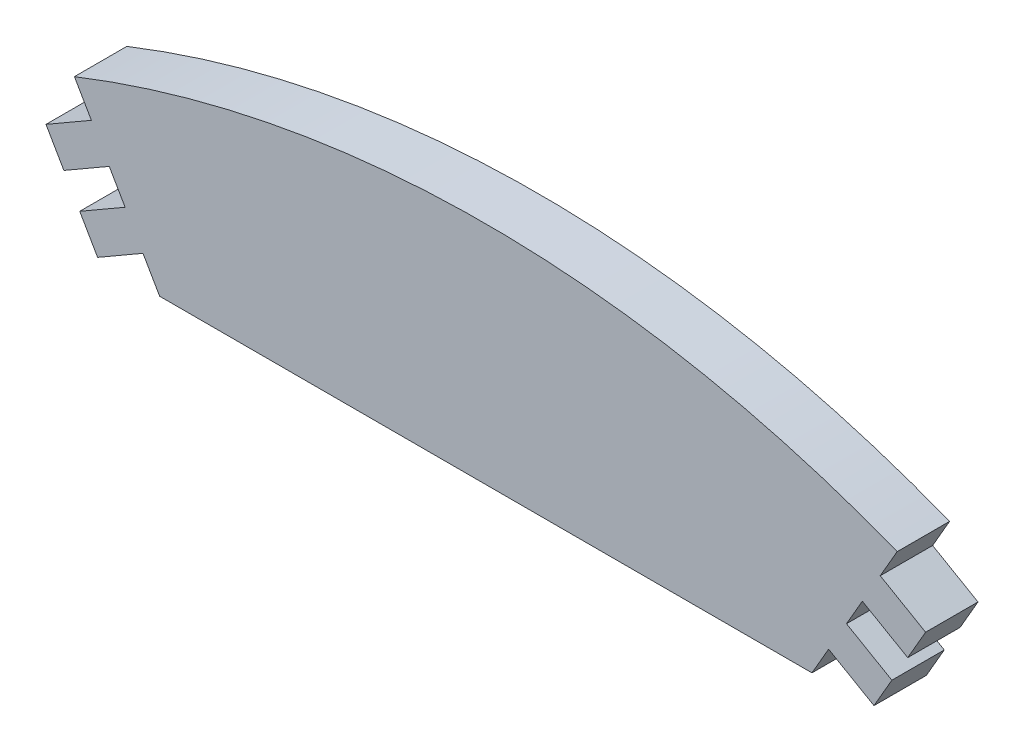
ISO-10303-21;
HEADER;
FILE_DESCRIPTION(('STEP AP214'),'2;1');
FILE_NAME('part.step','',(''),(''),'','','');
FILE_SCHEMA(('AUTOMOTIVE_DESIGN { 1 0 10303 214 1 1 1 1 }'));
ENDSEC;
DATA;
#1=APPLICATION_CONTEXT('core data for automotive mechanical design processes');
#2=APPLICATION_PROTOCOL_DEFINITION('international standard','automotive_design',2000,#1);
#3=PRODUCT_CONTEXT('',#1,'mechanical');
#4=PRODUCT('Part','Part','',(#3));
#5=PRODUCT_RELATED_PRODUCT_CATEGORY('part','',(#4));
#6=PRODUCT_DEFINITION_FORMATION('','',#4);
#7=PRODUCT_DEFINITION_CONTEXT('part definition',#1,'design');
#8=PRODUCT_DEFINITION('design','',#6,#7);
#9=PRODUCT_DEFINITION_SHAPE('','',#8);
#10=(LENGTH_UNIT() NAMED_UNIT(*) SI_UNIT(.MILLI.,.METRE.));
#11=(NAMED_UNIT(*) PLANE_ANGLE_UNIT() SI_UNIT($,.RADIAN.));
#12=(NAMED_UNIT(*) SI_UNIT($,.STERADIAN.) SOLID_ANGLE_UNIT());
#13=UNCERTAINTY_MEASURE_WITH_UNIT(LENGTH_MEASURE(1.E-05),#10,'distance_accuracy_value','');
#14=(GEOMETRIC_REPRESENTATION_CONTEXT(3) GLOBAL_UNCERTAINTY_ASSIGNED_CONTEXT((#13)) GLOBAL_UNIT_ASSIGNED_CONTEXT((#10,
#11,#12)) REPRESENTATION_CONTEXT('',''));
#15=CARTESIAN_POINT('',(0.,0.,0.));
#16=DIRECTION('',(0.,0.,1.));
#17=DIRECTION('',(1.,0.,0.));
#18=AXIS2_PLACEMENT_3D('',#15,#16,#17);
#19=CARTESIAN_POINT('',(-32.057735026919,87.9,5.15));
#20=DIRECTION('',(0.866025403784439,0.499999999999999,0.));
#21=DIRECTION('',(-0.499999999999999,0.866025403784439,0.));
#22=AXIS2_PLACEMENT_3D('',#19,#20,#21);
#23=PLANE('',#22);
#24=DIRECTION('',(0.499999999999999,-0.866025403784439,0.));
#25=VECTOR('',#24,1.);
#26=CARTESIAN_POINT('',(-32.057735026919,87.9,0.));
#27=LINE('',#26,#25);
#28=CARTESIAN_POINT('',(-33.6943323793796,90.7346697659945,0.));
#29=VERTEX_POINT('',#28);
#30=CARTESIAN_POINT('',(-32.057735026919,87.9,0.));
#31=VERTEX_POINT('',#30);
#32=EDGE_CURVE('E356',#29,#31,#27,.T.);
#33=ORIENTED_EDGE('',*,*,#32,.T.);
#34=DIRECTION('',(0.,0.,-1.));
#35=VECTOR('',#34,1.);
#36=CARTESIAN_POINT('',(-32.057735026919,87.9,5.15));
#37=LINE('',#36,#35);
#38=CARTESIAN_POINT('',(-32.057735026919,87.9,5.15));
#39=VERTEX_POINT('',#38);
#40=EDGE_CURVE('E12',#39,#31,#37,.T.);
#41=ORIENTED_EDGE('',*,*,#40,.F.);
#42=DIRECTION('',(0.499999999999999,-0.866025403784439,0.));
#43=VECTOR('',#42,1.);
#44=CARTESIAN_POINT('',(-32.057735026919,87.9,5.15));
#45=LINE('',#44,#43);
#46=CARTESIAN_POINT('',(-33.6943323793796,90.7346697659945,5.15));
#47=VERTEX_POINT('',#46);
#48=EDGE_CURVE('E285',#47,#39,#45,.T.);
#49=ORIENTED_EDGE('',*,*,#48,.F.);
#50=DIRECTION('',(0.,0.,-1.));
#51=VECTOR('',#50,1.);
#52=CARTESIAN_POINT('',(-33.6943323793796,90.7346697659945,5.15));
#53=LINE('',#52,#51);
#54=EDGE_CURVE('E203',#47,#29,#53,.T.);
#55=ORIENTED_EDGE('',*,*,#54,.T.);
#56=EDGE_LOOP('',(#33,#41,#49,#55));
#57=FACE_BOUND('',#56,.T.);
#58=ADVANCED_FACE('F36',(#57),#23,.F.);
#59=CARTESIAN_POINT('',(-32.057735026919,87.9,5.15));
#60=DIRECTION('',(0.,1.,0.));
#61=DIRECTION('',(0.,0.,1.));
#62=AXIS2_PLACEMENT_3D('',#59,#60,#61);
#63=PLANE('',#62);
#64=DIRECTION('',(1.,0.,0.));
#65=VECTOR('',#64,1.);
#66=CARTESIAN_POINT('',(-32.057735026919,87.9,0.));
#67=LINE('',#66,#65);
#68=CARTESIAN_POINT('',(32.057735026919,87.9,0.));
#69=VERTEX_POINT('',#68);
#70=EDGE_CURVE('E350',#31,#69,#67,.T.);
#71=ORIENTED_EDGE('',*,*,#70,.T.);
#72=DIRECTION('',(0.,0.,-1.));
#73=VECTOR('',#72,1.);
#74=CARTESIAN_POINT('',(32.057735026919,87.9,5.15));
#75=LINE('',#74,#73);
#76=CARTESIAN_POINT('',(32.057735026919,87.9,5.15));
#77=VERTEX_POINT('',#76);
#78=EDGE_CURVE('E44',#77,#69,#75,.T.);
#79=ORIENTED_EDGE('',*,*,#78,.F.);
#80=DIRECTION('',(1.,0.,0.));
#81=VECTOR('',#80,1.);
#82=CARTESIAN_POINT('',(-32.057735026919,87.9,5.15));
#83=LINE('',#82,#81);
#84=EDGE_CURVE('E131',#39,#77,#83,.T.);
#85=ORIENTED_EDGE('',*,*,#84,.F.);
#86=ORIENTED_EDGE('',*,*,#40,.T.);
#87=EDGE_LOOP('',(#71,#79,#85,#86));
#88=FACE_BOUND('',#87,.T.);
#89=ADVANCED_FACE('F401',(#88),#63,.F.);
#90=CARTESIAN_POINT('',(32.057735026919,87.9,5.15));
#91=DIRECTION('',(-0.866025403784439,0.499999999999999,0.));
#92=DIRECTION('',(-0.499999999999999,-0.866025403784439,0.));
#93=AXIS2_PLACEMENT_3D('',#90,#91,#92);
#94=PLANE('',#93);
#95=DIRECTION('',(0.499999999999999,0.866025403784439,0.));
#96=VECTOR('',#95,1.);
#97=CARTESIAN_POINT('',(32.057735026919,87.9,0.));
#98=LINE('',#97,#96);
#99=CARTESIAN_POINT('',(33.6943323793796,90.7346697659945,0.));
#100=VERTEX_POINT('',#99);
#101=EDGE_CURVE('E345',#69,#100,#98,.T.);
#102=ORIENTED_EDGE('',*,*,#101,.T.);
#103=DIRECTION('',(0.,0.,-1.));
#104=VECTOR('',#103,1.);
#105=CARTESIAN_POINT('',(33.6943323793796,90.7346697659945,5.15));
#106=LINE('',#105,#104);
#107=CARTESIAN_POINT('',(33.6943323793796,90.7346697659945,5.15));
#108=VERTEX_POINT('',#107);
#109=EDGE_CURVE('E337',#108,#100,#106,.T.);
#110=ORIENTED_EDGE('',*,*,#109,.F.);
#111=DIRECTION('',(0.499999999999999,0.866025403784439,0.));
#112=VECTOR('',#111,1.);
#113=CARTESIAN_POINT('',(32.057735026919,87.9,5.15));
#114=LINE('',#113,#112);
#115=EDGE_CURVE('E277',#77,#108,#114,.T.);
#116=ORIENTED_EDGE('',*,*,#115,.F.);
#117=ORIENTED_EDGE('',*,*,#78,.T.);
#118=EDGE_LOOP('',(#102,#110,#116,#117));
#119=FACE_BOUND('',#118,.T.);
#120=ADVANCED_FACE('F343',(#119),#94,.F.);
#121=CARTESIAN_POINT('',(33.6943323793796,90.7346697659945,5.15));
#122=DIRECTION('',(0.5,0.866025403784439,0.));
#123=DIRECTION('',(-0.866025403784439,0.5,0.));
#124=AXIS2_PLACEMENT_3D('',#121,#122,#123);
#125=PLANE('',#124);
#126=DIRECTION('',(0.866025403784439,-0.5,0.));
#127=VECTOR('',#126,1.);
#128=CARTESIAN_POINT('',(33.6943323793796,90.7346697659945,0.));
#129=LINE('',#128,#127);
#130=CARTESIAN_POINT('',(38.1543632088692,88.1596697659946,0.));
#131=VERTEX_POINT('',#130);
#132=EDGE_CURVE('E352',#100,#131,#129,.T.);
#133=ORIENTED_EDGE('',*,*,#132,.T.);
#134=DIRECTION('',(0.,0.,-1.));
#135=VECTOR('',#134,1.);
#136=CARTESIAN_POINT('',(38.1543632088692,88.1596697659946,5.15));
#137=LINE('',#136,#135);
#138=CARTESIAN_POINT('',(38.1543632088692,88.1596697659946,5.15));
#139=VERTEX_POINT('',#138);
#140=EDGE_CURVE('E334',#139,#131,#137,.T.);
#141=ORIENTED_EDGE('',*,*,#140,.F.);
#142=DIRECTION('',(0.866025403784439,-0.5,0.));
#143=VECTOR('',#142,1.);
#144=CARTESIAN_POINT('',(33.6943323793796,90.7346697659945,5.15));
#145=LINE('',#144,#143);
#146=EDGE_CURVE('E273',#108,#139,#145,.T.);
#147=ORIENTED_EDGE('',*,*,#146,.F.);
#148=ORIENTED_EDGE('',*,*,#109,.T.);
#149=EDGE_LOOP('',(#133,#141,#147,#148));
#150=FACE_BOUND('',#149,.T.);
#151=ADVANCED_FACE('F408',(#150),#125,.F.);
#152=CARTESIAN_POINT('',(38.1543632088692,88.1596697659946,5.15));
#153=DIRECTION('',(-0.866025403784438,0.500000000000001,0.));
#154=DIRECTION('',(-0.500000000000001,-0.866025403784438,0.));
#155=AXIS2_PLACEMENT_3D('',#152,#153,#154);
#156=PLANE('',#155);
#157=DIRECTION('',(0.500000000000001,0.866025403784438,0.));
#158=VECTOR('',#157,1.);
#159=CARTESIAN_POINT('',(38.1543632088692,88.1596697659946,0.));
#160=LINE('',#159,#158);
#161=CARTESIAN_POINT('',(39.9120930478703,91.2041471531244,0.));
#162=VERTEX_POINT('',#161);
#163=EDGE_CURVE('E354',#131,#162,#160,.T.);
#164=ORIENTED_EDGE('',*,*,#163,.T.);
#165=DIRECTION('',(0.,0.,-1.));
#166=VECTOR('',#165,1.);
#167=CARTESIAN_POINT('',(39.9120930478703,91.2041471531244,5.15));
#168=LINE('',#167,#166);
#169=CARTESIAN_POINT('',(39.9120930478703,91.2041471531244,5.15));
#170=VERTEX_POINT('',#169);
#171=EDGE_CURVE('E331',#170,#162,#168,.T.);
#172=ORIENTED_EDGE('',*,*,#171,.F.);
#173=DIRECTION('',(0.500000000000001,0.866025403784438,0.));
#174=VECTOR('',#173,1.);
#175=CARTESIAN_POINT('',(38.1543632088692,88.1596697659946,5.15));
#176=LINE('',#175,#174);
#177=EDGE_CURVE('E270',#139,#170,#176,.T.);
#178=ORIENTED_EDGE('',*,*,#177,.F.);
#179=ORIENTED_EDGE('',*,*,#140,.T.);
#180=EDGE_LOOP('',(#164,#172,#178,#179));
#181=FACE_BOUND('',#180,.T.);
#182=ADVANCED_FACE('F413',(#181),#156,.F.);
#183=CARTESIAN_POINT('',(39.9120930478703,91.2041471531244,5.15));
#184=DIRECTION('',(-0.500000000000001,-0.866025403784438,0.));
#185=DIRECTION('',(0.866025403784438,-0.500000000000001,0.));
#186=AXIS2_PLACEMENT_3D('',#183,#184,#185);
#187=PLANE('',#186);
#188=DIRECTION('',(-0.866025403784438,0.500000000000001,0.));
#189=VECTOR('',#188,1.);
#190=CARTESIAN_POINT('',(39.9120930478703,91.2041471531244,0.));
#191=LINE('',#190,#189);
#192=CARTESIAN_POINT('',(35.4520622183807,93.7791471531243,0.));
#193=VERTEX_POINT('',#192);
#194=EDGE_CURVE('E360',#162,#193,#191,.T.);
#195=ORIENTED_EDGE('',*,*,#194,.T.);
#196=DIRECTION('',(0.,0.,-1.));
#197=VECTOR('',#196,1.);
#198=CARTESIAN_POINT('',(35.4520622183807,93.7791471531243,5.15));
#199=LINE('',#198,#197);
#200=CARTESIAN_POINT('',(35.4520622183807,93.7791471531243,5.15));
#201=VERTEX_POINT('',#200);
#202=EDGE_CURVE('E328',#201,#193,#199,.T.);
#203=ORIENTED_EDGE('',*,*,#202,.F.);
#204=DIRECTION('',(-0.866025403784438,0.500000000000001,0.));
#205=VECTOR('',#204,1.);
#206=CARTESIAN_POINT('',(39.9120930478703,91.2041471531244,5.15));
#207=LINE('',#206,#205);
#208=EDGE_CURVE('E262',#170,#201,#207,.T.);
#209=ORIENTED_EDGE('',*,*,#208,.F.);
#210=ORIENTED_EDGE('',*,*,#171,.T.);
#211=EDGE_LOOP('',(#195,#203,#209,#210));
#212=FACE_BOUND('',#211,.T.);
#213=ADVANCED_FACE('F417',(#212),#187,.F.);
#214=CARTESIAN_POINT('',(35.4520622183807,93.7791471531243,5.15));
#215=DIRECTION('',(-0.866025403784438,0.500000000000001,0.));
#216=DIRECTION('',(-0.500000000000001,-0.866025403784438,0.));
#217=AXIS2_PLACEMENT_3D('',#214,#215,#216);
#218=PLANE('',#217);
#219=DIRECTION('',(0.5,0.866025403784438,0.));
#220=VECTOR('',#219,1.);
#221=CARTESIAN_POINT('',(35.4520622183807,93.7791471531243,0.));
#222=LINE('',#221,#220);
#223=CARTESIAN_POINT('',(37.0097920573818,96.4772143787403,0.));
#224=VERTEX_POINT('',#223);
#225=EDGE_CURVE('E362',#193,#224,#222,.T.);
#226=ORIENTED_EDGE('',*,*,#225,.T.);
#227=DIRECTION('',(0.,0.,-1.));
#228=VECTOR('',#227,1.);
#229=CARTESIAN_POINT('',(37.0097920573818,96.4772143787403,5.15));
#230=LINE('',#229,#228);
#231=CARTESIAN_POINT('',(37.0097920573818,96.4772143787403,5.15));
#232=VERTEX_POINT('',#231);
#233=EDGE_CURVE('E325',#232,#224,#230,.T.);
#234=ORIENTED_EDGE('',*,*,#233,.F.);
#235=DIRECTION('',(0.5,0.866025403784438,0.));
#236=VECTOR('',#235,1.);
#237=CARTESIAN_POINT('',(35.4520622183807,93.7791471531243,5.15));
#238=LINE('',#237,#236);
#239=EDGE_CURVE('E258',#201,#232,#238,.T.);
#240=ORIENTED_EDGE('',*,*,#239,.F.);
#241=ORIENTED_EDGE('',*,*,#202,.T.);
#242=EDGE_LOOP('',(#226,#234,#240,#241));
#243=FACE_BOUND('',#242,.T.);
#244=ADVANCED_FACE('F421',(#243),#218,.F.);
#245=CARTESIAN_POINT('',(37.0097920573818,96.4772143787403,5.15));
#246=DIRECTION('',(0.499999999999999,0.866025403784439,0.));
#247=DIRECTION('',(-0.866025403784439,0.5,0.));
#248=AXIS2_PLACEMENT_3D('',#245,#246,#247);
#249=PLANE('',#248);
#250=DIRECTION('',(0.866025403784439,-0.499999999999999,0.));
#251=VECTOR('',#250,1.);
#252=CARTESIAN_POINT('',(37.0097920573818,96.4772143787403,0.));
#253=LINE('',#252,#251);
#254=CARTESIAN_POINT('',(41.4698228868716,93.9022143787403,0.));
#255=VERTEX_POINT('',#254);
#256=EDGE_CURVE('E364',#224,#255,#253,.T.);
#257=ORIENTED_EDGE('',*,*,#256,.T.);
#258=DIRECTION('',(0.,0.,-1.));
#259=VECTOR('',#258,1.);
#260=CARTESIAN_POINT('',(41.4698228868716,93.9022143787403,5.15));
#261=LINE('',#260,#259);
#262=CARTESIAN_POINT('',(41.4698228868716,93.9022143787403,5.15));
#263=VERTEX_POINT('',#262);
#264=EDGE_CURVE('E322',#263,#255,#261,.T.);
#265=ORIENTED_EDGE('',*,*,#264,.F.);
#266=DIRECTION('',(0.866025403784439,-0.499999999999999,0.));
#267=VECTOR('',#266,1.);
#268=CARTESIAN_POINT('',(37.0097920573818,96.4772143787403,5.15));
#269=LINE('',#268,#267);
#270=EDGE_CURVE('E254',#232,#263,#269,.T.);
#271=ORIENTED_EDGE('',*,*,#270,.F.);
#272=ORIENTED_EDGE('',*,*,#233,.T.);
#273=EDGE_LOOP('',(#257,#265,#271,#272));
#274=FACE_BOUND('',#273,.T.);
#275=ADVANCED_FACE('F425',(#274),#249,.F.);
#276=CARTESIAN_POINT('',(41.4698228868716,93.9022143787403,5.15));
#277=DIRECTION('',(-0.866025403784439,0.499999999999999,0.));
#278=DIRECTION('',(-0.499999999999999,-0.866025403784439,0.));
#279=AXIS2_PLACEMENT_3D('',#276,#277,#278);
#280=PLANE('',#279);
#281=DIRECTION('',(0.499999999999999,0.866025403784439,0.));
#282=VECTOR('',#281,1.);
#283=CARTESIAN_POINT('',(41.4698228868716,93.9022143787403,0.));
#284=LINE('',#283,#282);
#285=CARTESIAN_POINT('',(43.2275527258728,96.9466917658702,0.));
#286=VERTEX_POINT('',#285);
#287=EDGE_CURVE('E366',#255,#286,#284,.T.);
#288=ORIENTED_EDGE('',*,*,#287,.T.);
#289=DIRECTION('',(0.,0.,-1.));
#290=VECTOR('',#289,1.);
#291=CARTESIAN_POINT('',(43.2275527258728,96.9466917658702,5.15));
#292=LINE('',#291,#290);
#293=CARTESIAN_POINT('',(43.2275527258728,96.9466917658702,5.15));
#294=VERTEX_POINT('',#293);
#295=EDGE_CURVE('E319',#294,#286,#292,.T.);
#296=ORIENTED_EDGE('',*,*,#295,.F.);
#297=DIRECTION('',(0.499999999999999,0.866025403784439,0.));
#298=VECTOR('',#297,1.);
#299=CARTESIAN_POINT('',(41.4698228868716,93.9022143787403,5.15));
#300=LINE('',#299,#298);
#301=EDGE_CURVE('E251',#263,#294,#300,.T.);
#302=ORIENTED_EDGE('',*,*,#301,.F.);
#303=ORIENTED_EDGE('',*,*,#264,.T.);
#304=EDGE_LOOP('',(#288,#296,#302,#303));
#305=FACE_BOUND('',#304,.T.);
#306=ADVANCED_FACE('F429',(#305),#280,.F.);
#307=CARTESIAN_POINT('',(43.2275527258728,96.9466917658702,5.15));
#308=DIRECTION('',(-0.500000000000001,-0.866025403784438,0.));
#309=DIRECTION('',(0.866025403784438,-0.500000000000001,0.));
#310=AXIS2_PLACEMENT_3D('',#307,#308,#309);
#311=PLANE('',#310);
#312=DIRECTION('',(-0.866025403784438,0.500000000000001,0.));
#313=VECTOR('',#312,1.);
#314=CARTESIAN_POINT('',(43.2275527258728,96.9466917658702,0.));
#315=LINE('',#314,#313);
#316=CARTESIAN_POINT('',(38.7675218963829,99.5216917658702,0.));
#317=VERTEX_POINT('',#316);
#318=EDGE_CURVE('E368',#286,#317,#315,.T.);
#319=ORIENTED_EDGE('',*,*,#318,.T.);
#320=DIRECTION('',(0.,0.,-1.));
#321=VECTOR('',#320,1.);
#322=CARTESIAN_POINT('',(38.7675218963829,99.5216917658702,5.15));
#323=LINE('',#322,#321);
#324=CARTESIAN_POINT('',(38.7675218963829,99.5216917658702,5.15));
#325=VERTEX_POINT('',#324);
#326=EDGE_CURVE('E316',#325,#317,#323,.T.);
#327=ORIENTED_EDGE('',*,*,#326,.F.);
#328=DIRECTION('',(-0.866025403784438,0.500000000000001,0.));
#329=VECTOR('',#328,1.);
#330=CARTESIAN_POINT('',(43.2275527258728,96.9466917658702,5.15));
#331=LINE('',#330,#329);
#332=EDGE_CURVE('E243',#294,#325,#331,.T.);
#333=ORIENTED_EDGE('',*,*,#332,.F.);
#334=ORIENTED_EDGE('',*,*,#295,.T.);
#335=EDGE_LOOP('',(#319,#327,#333,#334));
#336=FACE_BOUND('',#335,.T.);
#337=ADVANCED_FACE('F433',(#336),#311,.F.);
#338=CARTESIAN_POINT('',(38.7675218963829,99.5216917658702,5.15));
#339=DIRECTION('',(-0.86602540378444,0.499999999999999,0.));
#340=DIRECTION('',(-0.499999999999999,-0.866025403784439,0.));
#341=AXIS2_PLACEMENT_3D('',#338,#339,#340);
#342=PLANE('',#341);
#343=DIRECTION('',(0.499999999999998,0.866025403784439,0.));
#344=VECTOR('',#343,1.);
#345=CARTESIAN_POINT('',(38.7675218963829,99.5216917658702,0.));
#346=LINE('',#345,#344);
#347=CARTESIAN_POINT('',(40.4332638413848,102.406841446912,0.));
#348=VERTEX_POINT('',#347);
#349=EDGE_CURVE('E370',#317,#348,#346,.T.);
#350=ORIENTED_EDGE('',*,*,#349,.T.);
#351=DIRECTION('',(0.,0.,-1.));
#352=VECTOR('',#351,1.);
#353=CARTESIAN_POINT('',(40.4332638413848,102.406841446912,5.15));
#354=LINE('',#353,#352);
#355=CARTESIAN_POINT('',(40.4332638413848,102.406841446912,5.15));
#356=VERTEX_POINT('',#355);
#357=EDGE_CURVE('E313',#356,#348,#354,.T.);
#358=ORIENTED_EDGE('',*,*,#357,.F.);
#359=DIRECTION('',(0.499999999999998,0.866025403784439,0.));
#360=VECTOR('',#359,1.);
#361=CARTESIAN_POINT('',(38.7675218963829,99.5216917658702,5.15));
#362=LINE('',#361,#360);
#363=EDGE_CURVE('E239',#325,#356,#362,.T.);
#364=ORIENTED_EDGE('',*,*,#363,.F.);
#365=ORIENTED_EDGE('',*,*,#326,.T.);
#366=EDGE_LOOP('',(#350,#358,#364,#365));
#367=FACE_BOUND('',#366,.T.);
#368=ADVANCED_FACE('F437',(#367),#342,.F.);
#369=CARTESIAN_POINT('',(0.,0.,5.15));
#370=DIRECTION('',(0.,0.,-1.));
#371=DIRECTION('',(-1.,0.,0.));
#372=AXIS2_PLACEMENT_3D('',#369,#370,#371);
#373=CYLINDRICAL_SURFACE('',#372,110.1);
#374=CARTESIAN_POINT('',(0.,0.,0.));
#375=DIRECTION('',(0.,0.,1.));
#376=DIRECTION('',(-1.,0.,0.));
#377=AXIS2_PLACEMENT_3D('',#374,#375,#376);
#378=CIRCLE('',#377,110.1);
#379=CARTESIAN_POINT('',(-40.4332638413848,102.406841446912,0.));
#380=VERTEX_POINT('',#379);
#381=EDGE_CURVE('E372',#348,#380,#378,.T.);
#382=ORIENTED_EDGE('',*,*,#381,.T.);
#383=DIRECTION('',(0.,0.,-1.));
#384=VECTOR('',#383,1.);
#385=CARTESIAN_POINT('',(-40.4332638413848,102.406841446912,5.15));
#386=LINE('',#385,#384);
#387=CARTESIAN_POINT('',(-40.4332638413848,102.406841446912,5.15));
#388=VERTEX_POINT('',#387);
#389=EDGE_CURVE('E310',#388,#380,#386,.T.);
#390=ORIENTED_EDGE('',*,*,#389,.F.);
#391=CARTESIAN_POINT('',(0.,0.,5.15));
#392=DIRECTION('',(0.,0.,1.));
#393=DIRECTION('',(-1.,0.,0.));
#394=AXIS2_PLACEMENT_3D('',#391,#392,#393);
#395=CIRCLE('',#394,110.1);
#396=EDGE_CURVE('E235',#356,#388,#395,.T.);
#397=ORIENTED_EDGE('',*,*,#396,.F.);
#398=ORIENTED_EDGE('',*,*,#357,.T.);
#399=EDGE_LOOP('',(#382,#390,#397,#398));
#400=FACE_BOUND('',#399,.T.);
#401=ADVANCED_FACE('F441',(#400),#373,.T.);
#402=CARTESIAN_POINT('',(-38.7675218963829,99.5216917658702,5.15));
#403=DIRECTION('',(0.86602540378444,0.499999999999999,0.));
#404=DIRECTION('',(-0.499999999999999,0.866025403784439,0.));
#405=AXIS2_PLACEMENT_3D('',#402,#403,#404);
#406=PLANE('',#405);
#407=DIRECTION('',(0.499999999999998,-0.866025403784439,0.));
#408=VECTOR('',#407,1.);
#409=CARTESIAN_POINT('',(-38.7675218963829,99.5216917658702,0.));
#410=LINE('',#409,#408);
#411=CARTESIAN_POINT('',(-38.7675218963829,99.5216917658702,0.));
#412=VERTEX_POINT('',#411);
#413=EDGE_CURVE('E374',#380,#412,#410,.T.);
#414=ORIENTED_EDGE('',*,*,#413,.T.);
#415=DIRECTION('',(0.,0.,-1.));
#416=VECTOR('',#415,1.);
#417=CARTESIAN_POINT('',(-38.7675218963829,99.5216917658702,5.15));
#418=LINE('',#417,#416);
#419=CARTESIAN_POINT('',(-38.7675218963829,99.5216917658702,5.15));
#420=VERTEX_POINT('',#419);
#421=EDGE_CURVE('E307',#420,#412,#418,.T.);
#422=ORIENTED_EDGE('',*,*,#421,.F.);
#423=DIRECTION('',(0.499999999999998,-0.866025403784439,0.));
#424=VECTOR('',#423,1.);
#425=CARTESIAN_POINT('',(-38.7675218963829,99.5216917658702,5.15));
#426=LINE('',#425,#424);
#427=EDGE_CURVE('E232',#388,#420,#426,.T.);
#428=ORIENTED_EDGE('',*,*,#427,.F.);
#429=ORIENTED_EDGE('',*,*,#389,.T.);
#430=EDGE_LOOP('',(#414,#422,#428,#429));
#431=FACE_BOUND('',#430,.T.);
#432=ADVANCED_FACE('F445',(#431),#406,.F.);
#433=CARTESIAN_POINT('',(-43.2275527258728,96.9466917658702,5.15));
#434=DIRECTION('',(0.500000000000001,-0.866025403784438,0.));
#435=DIRECTION('',(0.866025403784438,0.500000000000001,0.));
#436=AXIS2_PLACEMENT_3D('',#433,#434,#435);
#437=PLANE('',#436);
#438=DIRECTION('',(-0.866025403784438,-0.500000000000001,0.));
#439=VECTOR('',#438,1.);
#440=CARTESIAN_POINT('',(-43.2275527258728,96.9466917658702,0.));
#441=LINE('',#440,#439);
#442=CARTESIAN_POINT('',(-43.2275527258728,96.9466917658702,0.));
#443=VERTEX_POINT('',#442);
#444=EDGE_CURVE('E376',#412,#443,#441,.T.);
#445=ORIENTED_EDGE('',*,*,#444,.T.);
#446=DIRECTION('',(0.,0.,-1.));
#447=VECTOR('',#446,1.);
#448=CARTESIAN_POINT('',(-43.2275527258728,96.9466917658702,5.15));
#449=LINE('',#448,#447);
#450=CARTESIAN_POINT('',(-43.2275527258728,96.9466917658702,5.15));
#451=VERTEX_POINT('',#450);
#452=EDGE_CURVE('E304',#451,#443,#449,.T.);
#453=ORIENTED_EDGE('',*,*,#452,.F.);
#454=DIRECTION('',(-0.866025403784438,-0.500000000000001,0.));
#455=VECTOR('',#454,1.);
#456=CARTESIAN_POINT('',(-43.2275527258728,96.9466917658702,5.15));
#457=LINE('',#456,#455);
#458=EDGE_CURVE('E224',#420,#451,#457,.T.);
#459=ORIENTED_EDGE('',*,*,#458,.F.);
#460=ORIENTED_EDGE('',*,*,#421,.T.);
#461=EDGE_LOOP('',(#445,#453,#459,#460));
#462=FACE_BOUND('',#461,.T.);
#463=ADVANCED_FACE('F449',(#462),#437,.F.);
#464=CARTESIAN_POINT('',(-41.4698228868716,93.9022143787403,5.15));
#465=DIRECTION('',(0.866025403784439,0.499999999999999,0.));
#466=DIRECTION('',(-0.499999999999999,0.866025403784439,0.));
#467=AXIS2_PLACEMENT_3D('',#464,#465,#466);
#468=PLANE('',#467);
#469=DIRECTION('',(0.499999999999999,-0.866025403784439,0.));
#470=VECTOR('',#469,1.);
#471=CARTESIAN_POINT('',(-41.4698228868716,93.9022143787403,0.));
#472=LINE('',#471,#470);
#473=CARTESIAN_POINT('',(-41.4698228868716,93.9022143787403,0.));
#474=VERTEX_POINT('',#473);
#475=EDGE_CURVE('E378',#443,#474,#472,.T.);
#476=ORIENTED_EDGE('',*,*,#475,.T.);
#477=DIRECTION('',(0.,0.,-1.));
#478=VECTOR('',#477,1.);
#479=CARTESIAN_POINT('',(-41.4698228868716,93.9022143787403,5.15));
#480=LINE('',#479,#478);
#481=CARTESIAN_POINT('',(-41.4698228868716,93.9022143787403,5.15));
#482=VERTEX_POINT('',#481);
#483=EDGE_CURVE('E301',#482,#474,#480,.T.);
#484=ORIENTED_EDGE('',*,*,#483,.F.);
#485=DIRECTION('',(0.499999999999999,-0.866025403784439,0.));
#486=VECTOR('',#485,1.);
#487=CARTESIAN_POINT('',(-41.4698228868716,93.9022143787403,5.15));
#488=LINE('',#487,#486);
#489=EDGE_CURVE('E220',#451,#482,#488,.T.);
#490=ORIENTED_EDGE('',*,*,#489,.F.);
#491=ORIENTED_EDGE('',*,*,#452,.T.);
#492=EDGE_LOOP('',(#476,#484,#490,#491));
#493=FACE_BOUND('',#492,.T.);
#494=ADVANCED_FACE('F453',(#493),#468,.F.);
#495=CARTESIAN_POINT('',(-37.0097920573818,96.4772143787403,5.15));
#496=DIRECTION('',(-0.499999999999999,0.866025403784439,0.));
#497=DIRECTION('',(-0.866025403784439,-0.5,0.));
#498=AXIS2_PLACEMENT_3D('',#495,#496,#497);
#499=PLANE('',#498);
#500=DIRECTION('',(0.866025403784439,0.499999999999999,0.));
#501=VECTOR('',#500,1.);
#502=CARTESIAN_POINT('',(-37.0097920573818,96.4772143787403,0.));
#503=LINE('',#502,#501);
#504=CARTESIAN_POINT('',(-37.0097920573818,96.4772143787403,0.));
#505=VERTEX_POINT('',#504);
#506=EDGE_CURVE('E380',#474,#505,#503,.T.);
#507=ORIENTED_EDGE('',*,*,#506,.T.);
#508=DIRECTION('',(0.,0.,-1.));
#509=VECTOR('',#508,1.);
#510=CARTESIAN_POINT('',(-37.0097920573818,96.4772143787403,5.15));
#511=LINE('',#510,#509);
#512=CARTESIAN_POINT('',(-37.0097920573818,96.4772143787403,5.15));
#513=VERTEX_POINT('',#512);
#514=EDGE_CURVE('E298',#513,#505,#511,.T.);
#515=ORIENTED_EDGE('',*,*,#514,.F.);
#516=DIRECTION('',(0.866025403784439,0.499999999999999,0.));
#517=VECTOR('',#516,1.);
#518=CARTESIAN_POINT('',(-37.0097920573818,96.4772143787403,5.15));
#519=LINE('',#518,#517);
#520=EDGE_CURVE('E216',#482,#513,#519,.T.);
#521=ORIENTED_EDGE('',*,*,#520,.F.);
#522=ORIENTED_EDGE('',*,*,#483,.T.);
#523=EDGE_LOOP('',(#507,#515,#521,#522));
#524=FACE_BOUND('',#523,.T.);
#525=ADVANCED_FACE('F457',(#524),#499,.F.);
#526=CARTESIAN_POINT('',(-35.4520622183807,93.7791471531243,5.15));
#527=DIRECTION('',(0.866025403784438,0.500000000000001,0.));
#528=DIRECTION('',(-0.500000000000001,0.866025403784438,0.));
#529=AXIS2_PLACEMENT_3D('',#526,#527,#528);
#530=PLANE('',#529);
#531=DIRECTION('',(0.5,-0.866025403784438,0.));
#532=VECTOR('',#531,1.);
#533=CARTESIAN_POINT('',(-35.4520622183807,93.7791471531243,0.));
#534=LINE('',#533,#532);
#535=CARTESIAN_POINT('',(-35.4520622183807,93.7791471531243,0.));
#536=VERTEX_POINT('',#535);
#537=EDGE_CURVE('E382',#505,#536,#534,.T.);
#538=ORIENTED_EDGE('',*,*,#537,.T.);
#539=DIRECTION('',(0.,0.,-1.));
#540=VECTOR('',#539,1.);
#541=CARTESIAN_POINT('',(-35.4520622183807,93.7791471531243,5.15));
#542=LINE('',#541,#540);
#543=CARTESIAN_POINT('',(-35.4520622183807,93.7791471531243,5.15));
#544=VERTEX_POINT('',#543);
#545=EDGE_CURVE('E196',#544,#536,#542,.T.);
#546=ORIENTED_EDGE('',*,*,#545,.F.);
#547=DIRECTION('',(0.5,-0.866025403784438,0.));
#548=VECTOR('',#547,1.);
#549=CARTESIAN_POINT('',(-35.4520622183807,93.7791471531243,5.15));
#550=LINE('',#549,#548);
#551=EDGE_CURVE('E186',#513,#544,#550,.T.);
#552=ORIENTED_EDGE('',*,*,#551,.F.);
#553=ORIENTED_EDGE('',*,*,#514,.T.);
#554=EDGE_LOOP('',(#538,#546,#552,#553));
#555=FACE_BOUND('',#554,.T.);
#556=ADVANCED_FACE('F385',(#555),#530,.F.);
#557=CARTESIAN_POINT('',(-39.9120930478703,91.2041471531244,5.15));
#558=DIRECTION('',(0.500000000000001,-0.866025403784438,0.));
#559=DIRECTION('',(0.866025403784438,0.500000000000001,0.));
#560=AXIS2_PLACEMENT_3D('',#557,#558,#559);
#561=PLANE('',#560);
#562=DIRECTION('',(-0.866025403784438,-0.500000000000001,0.));
#563=VECTOR('',#562,1.);
#564=CARTESIAN_POINT('',(-39.9120930478703,91.2041471531244,0.));
#565=LINE('',#564,#563);
#566=CARTESIAN_POINT('',(-39.9120930478703,91.2041471531244,0.));
#567=VERTEX_POINT('',#566);
#568=EDGE_CURVE('E195',#536,#567,#565,.T.);
#569=ORIENTED_EDGE('',*,*,#568,.T.);
#570=DIRECTION('',(0.,0.,-1.));
#571=VECTOR('',#570,1.);
#572=CARTESIAN_POINT('',(-39.9120930478703,91.2041471531244,5.15));
#573=LINE('',#572,#571);
#574=CARTESIAN_POINT('',(-39.9120930478703,91.2041471531244,5.15));
#575=VERTEX_POINT('',#574);
#576=EDGE_CURVE('E192',#575,#567,#573,.T.);
#577=ORIENTED_EDGE('',*,*,#576,.F.);
#578=DIRECTION('',(-0.866025403784438,-0.500000000000001,0.));
#579=VECTOR('',#578,1.);
#580=CARTESIAN_POINT('',(-39.9120930478703,91.2041471531244,5.15));
#581=LINE('',#580,#579);
#582=EDGE_CURVE('E180',#544,#575,#581,.T.);
#583=ORIENTED_EDGE('',*,*,#582,.F.);
#584=ORIENTED_EDGE('',*,*,#545,.T.);
#585=EDGE_LOOP('',(#569,#577,#583,#584));
#586=FACE_BOUND('',#585,.T.);
#587=ADVANCED_FACE('F193',(#586),#561,.F.);
#588=CARTESIAN_POINT('',(-38.1543632088692,88.1596697659946,5.15));
#589=DIRECTION('',(0.866025403784438,0.500000000000001,0.));
#590=DIRECTION('',(-0.500000000000001,0.866025403784438,0.));
#591=AXIS2_PLACEMENT_3D('',#588,#589,#590);
#592=PLANE('',#591);
#593=DIRECTION('',(0.500000000000001,-0.866025403784438,0.));
#594=VECTOR('',#593,1.);
#595=CARTESIAN_POINT('',(-38.1543632088692,88.1596697659946,0.));
#596=LINE('',#595,#594);
#597=CARTESIAN_POINT('',(-38.1543632088692,88.1596697659946,0.));
#598=VERTEX_POINT('',#597);
#599=EDGE_CURVE('E117',#567,#598,#596,.T.);
#600=ORIENTED_EDGE('',*,*,#599,.T.);
#601=DIRECTION('',(0.,0.,-1.));
#602=VECTOR('',#601,1.);
#603=CARTESIAN_POINT('',(-38.1543632088692,88.1596697659946,5.15));
#604=LINE('',#603,#602);
#605=CARTESIAN_POINT('',(-38.1543632088692,88.1596697659946,5.15));
#606=VERTEX_POINT('',#605);
#607=EDGE_CURVE('E197',#606,#598,#604,.T.);
#608=ORIENTED_EDGE('',*,*,#607,.F.);
#609=DIRECTION('',(0.500000000000001,-0.866025403784438,0.));
#610=VECTOR('',#609,1.);
#611=CARTESIAN_POINT('',(-38.1543632088692,88.1596697659946,5.15));
#612=LINE('',#611,#610);
#613=EDGE_CURVE('E184',#575,#606,#612,.T.);
#614=ORIENTED_EDGE('',*,*,#613,.F.);
#615=ORIENTED_EDGE('',*,*,#576,.T.);
#616=EDGE_LOOP('',(#600,#608,#614,#615));
#617=FACE_BOUND('',#616,.T.);
#618=ADVANCED_FACE('F199',(#617),#592,.F.);
#619=CARTESIAN_POINT('',(-33.6943323793796,90.7346697659945,5.15));
#620=DIRECTION('',(-0.5,0.866025403784439,0.));
#621=DIRECTION('',(-0.866025403784439,-0.5,0.));
#622=AXIS2_PLACEMENT_3D('',#619,#620,#621);
#623=PLANE('',#622);
#624=DIRECTION('',(0.866025403784439,0.5,0.));
#625=VECTOR('',#624,1.);
#626=CARTESIAN_POINT('',(-33.6943323793796,90.7346697659945,0.));
#627=LINE('',#626,#625);
#628=EDGE_CURVE('E123',#598,#29,#627,.T.);
#629=ORIENTED_EDGE('',*,*,#628,.T.);
#630=ORIENTED_EDGE('',*,*,#54,.F.);
#631=DIRECTION('',(0.866025403784439,0.5,0.));
#632=VECTOR('',#631,1.);
#633=CARTESIAN_POINT('',(-33.6943323793796,90.7346697659945,5.15));
#634=LINE('',#633,#632);
#635=EDGE_CURVE('E52',#606,#47,#634,.T.);
#636=ORIENTED_EDGE('',*,*,#635,.F.);
#637=ORIENTED_EDGE('',*,*,#607,.T.);
#638=EDGE_LOOP('',(#629,#630,#636,#637));
#639=FACE_BOUND('',#638,.T.);
#640=ADVANCED_FACE('F390',(#639),#623,.F.);
#641=CARTESIAN_POINT('',(0.,0.,5.15));
#642=DIRECTION('',(0.,0.,-1.));
#643=DIRECTION('',(-1.,0.,0.));
#644=AXIS2_PLACEMENT_3D('',#641,#642,#643);
#645=PLANE('',#644);
#646=ORIENTED_EDGE('',*,*,#48,.T.);
#647=ORIENTED_EDGE('',*,*,#84,.T.);
#648=ORIENTED_EDGE('',*,*,#115,.T.);
#649=ORIENTED_EDGE('',*,*,#146,.T.);
#650=ORIENTED_EDGE('',*,*,#177,.T.);
#651=ORIENTED_EDGE('',*,*,#208,.T.);
#652=ORIENTED_EDGE('',*,*,#239,.T.);
#653=ORIENTED_EDGE('',*,*,#270,.T.);
#654=ORIENTED_EDGE('',*,*,#301,.T.);
#655=ORIENTED_EDGE('',*,*,#332,.T.);
#656=ORIENTED_EDGE('',*,*,#363,.T.);
#657=ORIENTED_EDGE('',*,*,#396,.T.);
#658=ORIENTED_EDGE('',*,*,#427,.T.);
#659=ORIENTED_EDGE('',*,*,#458,.T.);
#660=ORIENTED_EDGE('',*,*,#489,.T.);
#661=ORIENTED_EDGE('',*,*,#520,.T.);
#662=ORIENTED_EDGE('',*,*,#551,.T.);
#663=ORIENTED_EDGE('',*,*,#582,.T.);
#664=ORIENTED_EDGE('',*,*,#613,.T.);
#665=ORIENTED_EDGE('',*,*,#635,.T.);
#666=EDGE_LOOP('',(#646,#647,#648,#649,#650,#651,#652,#653,#654,#655,#656,#657,#658,#659,#660,
#661,#662,#663,#664,#665));
#667=FACE_BOUND('',#666,.T.);
#668=ADVANCED_FACE('F182',(#667),#645,.F.);
#669=CARTESIAN_POINT('',(0.,0.,0.));
#670=DIRECTION('',(0.,0.,-1.));
#671=DIRECTION('',(-1.,0.,0.));
#672=AXIS2_PLACEMENT_3D('',#669,#670,#671);
#673=PLANE('',#672);
#674=ORIENTED_EDGE('',*,*,#32,.F.);
#675=ORIENTED_EDGE('',*,*,#628,.F.);
#676=ORIENTED_EDGE('',*,*,#599,.F.);
#677=ORIENTED_EDGE('',*,*,#568,.F.);
#678=ORIENTED_EDGE('',*,*,#537,.F.);
#679=ORIENTED_EDGE('',*,*,#506,.F.);
#680=ORIENTED_EDGE('',*,*,#475,.F.);
#681=ORIENTED_EDGE('',*,*,#444,.F.);
#682=ORIENTED_EDGE('',*,*,#413,.F.);
#683=ORIENTED_EDGE('',*,*,#381,.F.);
#684=ORIENTED_EDGE('',*,*,#349,.F.);
#685=ORIENTED_EDGE('',*,*,#318,.F.);
#686=ORIENTED_EDGE('',*,*,#287,.F.);
#687=ORIENTED_EDGE('',*,*,#256,.F.);
#688=ORIENTED_EDGE('',*,*,#225,.F.);
#689=ORIENTED_EDGE('',*,*,#194,.F.);
#690=ORIENTED_EDGE('',*,*,#163,.F.);
#691=ORIENTED_EDGE('',*,*,#132,.F.);
#692=ORIENTED_EDGE('',*,*,#101,.F.);
#693=ORIENTED_EDGE('',*,*,#70,.F.);
#694=EDGE_LOOP('',(#674,#675,#676,#677,#678,#679,#680,#681,#682,#683,#684,#685,#686,#687,#688,
#689,#690,#691,#692,#693));
#695=FACE_BOUND('',#694,.T.);
#696=ADVANCED_FACE('F349',(#695),#673,.T.);
#697=CLOSED_SHELL('',(#58,#89,#120,#151,#182,#213,#244,#275,#306,#337,#368,#401,#432,#463,#494,
#525,#556,#587,#618,#640,#668,#696));
#698=MANIFOLD_SOLID_BREP('B2',#697);
#699=ADVANCED_BREP_SHAPE_REPRESENTATION('',(#18,#698),#14);
#700=SHAPE_DEFINITION_REPRESENTATION(#9,#699);
ENDSEC;
END-ISO-10303-21;
